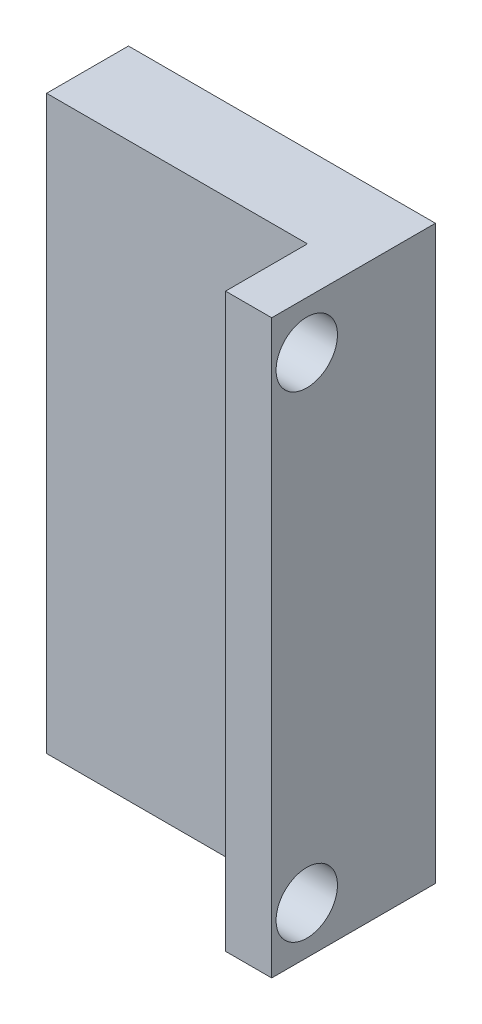
ISO-10303-21;
HEADER;
FILE_DESCRIPTION(('STEP AP214'),'2;1');
FILE_NAME('part.step','',(''),(''),'','','');
FILE_SCHEMA(('AUTOMOTIVE_DESIGN { 1 0 10303 214 1 1 1 1 }'));
ENDSEC;
DATA;
#1=APPLICATION_CONTEXT('core data for automotive mechanical design processes');
#2=APPLICATION_PROTOCOL_DEFINITION('international standard','automotive_design',2000,#1);
#3=PRODUCT_CONTEXT('',#1,'mechanical');
#4=PRODUCT('Part','Part','',(#3));
#5=PRODUCT_RELATED_PRODUCT_CATEGORY('part','',(#4));
#6=PRODUCT_DEFINITION_FORMATION('','',#4);
#7=PRODUCT_DEFINITION_CONTEXT('part definition',#1,'design');
#8=PRODUCT_DEFINITION('design','',#6,#7);
#9=PRODUCT_DEFINITION_SHAPE('','',#8);
#10=(LENGTH_UNIT() NAMED_UNIT(*) SI_UNIT(.MILLI.,.METRE.));
#11=(NAMED_UNIT(*) PLANE_ANGLE_UNIT() SI_UNIT($,.RADIAN.));
#12=(NAMED_UNIT(*) SI_UNIT($,.STERADIAN.) SOLID_ANGLE_UNIT());
#13=UNCERTAINTY_MEASURE_WITH_UNIT(LENGTH_MEASURE(1.E-05),#10,'distance_accuracy_value','');
#14=(GEOMETRIC_REPRESENTATION_CONTEXT(3) GLOBAL_UNCERTAINTY_ASSIGNED_CONTEXT((#13)) GLOBAL_UNIT_ASSIGNED_CONTEXT((#10,
#11,#12)) REPRESENTATION_CONTEXT('',''));
#15=CARTESIAN_POINT('',(0.,0.,0.));
#16=DIRECTION('',(0.,0.,1.));
#17=DIRECTION('',(1.,0.,0.));
#18=AXIS2_PLACEMENT_3D('',#15,#16,#17);
#19=CARTESIAN_POINT('',(0.,0.,5.));
#20=DIRECTION('',(1.,0.,0.));
#21=DIRECTION('',(0.,0.,-1.));
#22=AXIS2_PLACEMENT_3D('',#19,#20,#21);
#23=PLANE('',#22);
#24=DIRECTION('',(0.,-1.,0.));
#25=VECTOR('',#24,1.);
#26=CARTESIAN_POINT('',(0.,18.97,5.));
#27=LINE('',#26,#25);
#28=CARTESIAN_POINT('',(0.,18.97,5.));
#29=VERTEX_POINT('',#28);
#30=CARTESIAN_POINT('',(0.,-8.97,5.));
#31=VERTEX_POINT('',#30);
#32=EDGE_CURVE('E108',#29,#31,#27,.T.);
#33=ORIENTED_EDGE('',*,*,#32,.T.);
#34=DIRECTION('',(0.,0.,-1.));
#35=VECTOR('',#34,1.);
#36=CARTESIAN_POINT('',(0.,-8.97,9.));
#37=LINE('',#36,#35);
#38=CARTESIAN_POINT('',(0.,-8.97,9.));
#39=VERTEX_POINT('',#38);
#40=EDGE_CURVE('E48',#39,#31,#37,.T.);
#41=ORIENTED_EDGE('',*,*,#40,.F.);
#42=DIRECTION('',(0.,-1.,0.));
#43=VECTOR('',#42,1.);
#44=CARTESIAN_POINT('',(0.,18.97,9.));
#45=LINE('',#44,#43);
#46=CARTESIAN_POINT('',(0.,18.97,9.));
#47=VERTEX_POINT('',#46);
#48=EDGE_CURVE('E61',#47,#39,#45,.T.);
#49=ORIENTED_EDGE('',*,*,#48,.F.);
#50=DIRECTION('',(0.,0.,-1.));
#51=VECTOR('',#50,1.);
#52=CARTESIAN_POINT('',(0.,18.97,9.));
#53=LINE('',#52,#51);
#54=EDGE_CURVE('E11',#47,#29,#53,.T.);
#55=ORIENTED_EDGE('',*,*,#54,.T.);
#56=EDGE_LOOP('',(#33,#41,#49,#55));
#57=FACE_BOUND('',#56,.T.);
#58=ADVANCED_FACE('F41',(#57),#23,.F.);
#59=CARTESIAN_POINT('',(0.,0.,5.));
#60=DIRECTION('',(0.,0.,1.));
#61=DIRECTION('',(1.,0.,0.));
#62=AXIS2_PLACEMENT_3D('',#59,#60,#61);
#63=PLANE('',#62);
#64=DIRECTION('',(1.,0.,0.));
#65=VECTOR('',#64,1.);
#66=CARTESIAN_POINT('',(0.,-8.97,5.));
#67=LINE('',#66,#65);
#68=CARTESIAN_POINT('',(15.,-8.97,5.));
#69=VERTEX_POINT('',#68);
#70=EDGE_CURVE('E94',#31,#69,#67,.T.);
#71=ORIENTED_EDGE('',*,*,#70,.F.);
#72=ORIENTED_EDGE('',*,*,#32,.F.);
#73=DIRECTION('',(-1.,0.,0.));
#74=VECTOR('',#73,1.);
#75=CARTESIAN_POINT('',(15.,18.97,5.));
#76=LINE('',#75,#74);
#77=CARTESIAN_POINT('',(15.,18.97,5.));
#78=VERTEX_POINT('',#77);
#79=EDGE_CURVE('E100',#78,#29,#76,.T.);
#80=ORIENTED_EDGE('',*,*,#79,.F.);
#81=DIRECTION('',(0.,1.,0.));
#82=VECTOR('',#81,1.);
#83=CARTESIAN_POINT('',(15.,-8.97,5.));
#84=LINE('',#83,#82);
#85=EDGE_CURVE('E81',#69,#78,#84,.T.);
#86=ORIENTED_EDGE('',*,*,#85,.F.);
#87=EDGE_LOOP('',(#71,#72,#80,#86));
#88=FACE_BOUND('',#87,.T.);
#89=ADVANCED_FACE('F107',(#88),#63,.F.);
#90=CARTESIAN_POINT('',(15.,18.97,9.));
#91=DIRECTION('',(0.,-1.,0.));
#92=DIRECTION('',(0.,0.,-1.));
#93=AXIS2_PLACEMENT_3D('',#90,#91,#92);
#94=PLANE('',#93);
#95=ORIENTED_EDGE('',*,*,#79,.T.);
#96=ORIENTED_EDGE('',*,*,#54,.F.);
#97=DIRECTION('',(-1.,0.,0.));
#98=VECTOR('',#97,1.);
#99=CARTESIAN_POINT('',(15.,18.97,9.));
#100=LINE('',#99,#98);
#101=CARTESIAN_POINT('',(12.7455153503555,18.97,9.));
#102=VERTEX_POINT('',#101);
#103=EDGE_CURVE('E93',#102,#47,#100,.T.);
#104=ORIENTED_EDGE('',*,*,#103,.F.);
#105=DIRECTION('',(0.,0.,-1.));
#106=VECTOR('',#105,1.);
#107=CARTESIAN_POINT('',(12.7455153503555,18.97,13.));
#108=LINE('',#107,#106);
#109=CARTESIAN_POINT('',(12.7455153503555,18.97,13.));
#110=VERTEX_POINT('',#109);
#111=EDGE_CURVE('E109',#110,#102,#108,.T.);
#112=ORIENTED_EDGE('',*,*,#111,.F.);
#113=DIRECTION('',(-1.,0.,0.));
#114=VECTOR('',#113,1.);
#115=CARTESIAN_POINT('',(15.,18.97,13.));
#116=LINE('',#115,#114);
#117=CARTESIAN_POINT('',(15.,18.97,13.));
#118=VERTEX_POINT('',#117);
#119=EDGE_CURVE('E103',#118,#110,#116,.T.);
#120=ORIENTED_EDGE('',*,*,#119,.F.);
#121=DIRECTION('',(0.,0.,-1.));
#122=VECTOR('',#121,1.);
#123=CARTESIAN_POINT('',(15.,18.97,9.));
#124=LINE('',#123,#122);
#125=EDGE_CURVE('E86',#118,#78,#124,.T.);
#126=ORIENTED_EDGE('',*,*,#125,.T.);
#127=EDGE_LOOP('',(#95,#96,#104,#112,#120,#126));
#128=FACE_BOUND('',#127,.T.);
#129=ADVANCED_FACE('F98',(#128),#94,.F.);
#130=CARTESIAN_POINT('',(0.,-8.97,9.));
#131=DIRECTION('',(0.,1.,0.));
#132=DIRECTION('',(0.,0.,1.));
#133=AXIS2_PLACEMENT_3D('',#130,#131,#132);
#134=PLANE('',#133);
#135=ORIENTED_EDGE('',*,*,#70,.T.);
#136=DIRECTION('',(0.,0.,-1.));
#137=VECTOR('',#136,1.);
#138=CARTESIAN_POINT('',(15.,-8.97,9.));
#139=LINE('',#138,#137);
#140=CARTESIAN_POINT('',(15.,-8.97,13.));
#141=VERTEX_POINT('',#140);
#142=EDGE_CURVE('E89',#141,#69,#139,.T.);
#143=ORIENTED_EDGE('',*,*,#142,.F.);
#144=DIRECTION('',(1.,0.,0.));
#145=VECTOR('',#144,1.);
#146=CARTESIAN_POINT('',(15.,-8.97,13.));
#147=LINE('',#146,#145);
#148=CARTESIAN_POINT('',(12.7455153503555,-8.97,13.));
#149=VERTEX_POINT('',#148);
#150=EDGE_CURVE('E139',#149,#141,#147,.T.);
#151=ORIENTED_EDGE('',*,*,#150,.F.);
#152=DIRECTION('',(0.,0.,-1.));
#153=VECTOR('',#152,1.);
#154=CARTESIAN_POINT('',(12.7455153503555,-8.97,13.));
#155=LINE('',#154,#153);
#156=CARTESIAN_POINT('',(12.7455153503555,-8.97,9.));
#157=VERTEX_POINT('',#156);
#158=EDGE_CURVE('E113',#149,#157,#155,.T.);
#159=ORIENTED_EDGE('',*,*,#158,.T.);
#160=DIRECTION('',(1.,0.,0.));
#161=VECTOR('',#160,1.);
#162=CARTESIAN_POINT('',(0.,-8.97,9.));
#163=LINE('',#162,#161);
#164=EDGE_CURVE('E105',#39,#157,#163,.T.);
#165=ORIENTED_EDGE('',*,*,#164,.F.);
#166=ORIENTED_EDGE('',*,*,#40,.T.);
#167=EDGE_LOOP('',(#135,#143,#151,#159,#165,#166));
#168=FACE_BOUND('',#167,.T.);
#169=ADVANCED_FACE('F122',(#168),#134,.F.);
#170=CARTESIAN_POINT('',(15.,-8.97,9.));
#171=DIRECTION('',(-1.,0.,0.));
#172=DIRECTION('',(0.,0.,1.));
#173=AXIS2_PLACEMENT_3D('',#170,#171,#172);
#174=PLANE('',#173);
#175=CARTESIAN_POINT('',(15.,16.64426,11.286));
#176=DIRECTION('',(-1.,0.,0.));
#177=DIRECTION('',(0.,0.,1.));
#178=AXIS2_PLACEMENT_3D('',#175,#176,#177);
#179=CIRCLE('',#178,1.5);
#180=CARTESIAN_POINT('',(15.,16.64426,12.786));
#181=VERTEX_POINT('',#180);
#182=EDGE_CURVE('E147',#181,#181,#179,.T.);
#183=ORIENTED_EDGE('',*,*,#182,.T.);
#184=EDGE_LOOP('',(#183));
#185=FACE_BOUND('',#184,.T.);
#186=CARTESIAN_POINT('',(15.,-6.645,11.286));
#187=DIRECTION('',(-1.,0.,0.));
#188=DIRECTION('',(0.,0.,1.));
#189=AXIS2_PLACEMENT_3D('',#186,#187,#188);
#190=CIRCLE('',#189,1.5);
#191=CARTESIAN_POINT('',(15.,-6.645,12.786));
#192=VERTEX_POINT('',#191);
#193=EDGE_CURVE('E156',#192,#192,#190,.T.);
#194=ORIENTED_EDGE('',*,*,#193,.T.);
#195=EDGE_LOOP('',(#194));
#196=FACE_BOUND('',#195,.T.);
#197=ORIENTED_EDGE('',*,*,#85,.T.);
#198=ORIENTED_EDGE('',*,*,#125,.F.);
#199=DIRECTION('',(0.,1.,0.));
#200=VECTOR('',#199,1.);
#201=CARTESIAN_POINT('',(15.,18.97,13.));
#202=LINE('',#201,#200);
#203=EDGE_CURVE('E142',#141,#118,#202,.T.);
#204=ORIENTED_EDGE('',*,*,#203,.F.);
#205=ORIENTED_EDGE('',*,*,#142,.T.);
#206=EDGE_LOOP('',(#197,#198,#204,#205));
#207=FACE_BOUND('',#206,.T.);
#208=ADVANCED_FACE('F83',(#185,#196,#207),#174,.F.);
#209=CARTESIAN_POINT('',(0.,0.,9.));
#210=DIRECTION('',(0.,0.,1.));
#211=DIRECTION('',(1.,0.,0.));
#212=AXIS2_PLACEMENT_3D('',#209,#210,#211);
#213=PLANE('',#212);
#214=DIRECTION('',(0.,-1.,0.));
#215=VECTOR('',#214,1.);
#216=CARTESIAN_POINT('',(12.7455153503555,18.97,9.));
#217=LINE('',#216,#215);
#218=EDGE_CURVE('E55',#102,#157,#217,.T.);
#219=ORIENTED_EDGE('',*,*,#218,.F.);
#220=ORIENTED_EDGE('',*,*,#103,.T.);
#221=ORIENTED_EDGE('',*,*,#48,.T.);
#222=ORIENTED_EDGE('',*,*,#164,.T.);
#223=EDGE_LOOP('',(#219,#220,#221,#222));
#224=FACE_BOUND('',#223,.T.);
#225=ADVANCED_FACE('F148',(#224),#213,.T.);
#226=CARTESIAN_POINT('',(12.7455153503555,18.97,13.));
#227=DIRECTION('',(1.,0.,0.));
#228=DIRECTION('',(0.,0.,-1.));
#229=AXIS2_PLACEMENT_3D('',#226,#227,#228);
#230=PLANE('',#229);
#231=CARTESIAN_POINT('',(12.7455153503555,16.64426,11.286));
#232=DIRECTION('',(-1.,0.,0.));
#233=DIRECTION('',(0.,0.,1.));
#234=AXIS2_PLACEMENT_3D('',#231,#232,#233);
#235=CIRCLE('',#234,1.5);
#236=CARTESIAN_POINT('',(12.7455153503555,16.64426,12.786));
#237=VERTEX_POINT('',#236);
#238=EDGE_CURVE('E159',#237,#237,#235,.T.);
#239=ORIENTED_EDGE('',*,*,#238,.F.);
#240=EDGE_LOOP('',(#239));
#241=FACE_BOUND('',#240,.T.);
#242=CARTESIAN_POINT('',(12.7455153503555,-6.645,11.286));
#243=DIRECTION('',(-1.,0.,0.));
#244=DIRECTION('',(0.,0.,1.));
#245=AXIS2_PLACEMENT_3D('',#242,#243,#244);
#246=CIRCLE('',#245,1.5);
#247=CARTESIAN_POINT('',(12.7455153503555,-6.645,12.786));
#248=VERTEX_POINT('',#247);
#249=EDGE_CURVE('E160',#248,#248,#246,.T.);
#250=ORIENTED_EDGE('',*,*,#249,.F.);
#251=EDGE_LOOP('',(#250));
#252=FACE_BOUND('',#251,.T.);
#253=ORIENTED_EDGE('',*,*,#218,.T.);
#254=ORIENTED_EDGE('',*,*,#158,.F.);
#255=DIRECTION('',(0.,-1.,0.));
#256=VECTOR('',#255,1.);
#257=CARTESIAN_POINT('',(12.7455153503555,18.97,13.));
#258=LINE('',#257,#256);
#259=EDGE_CURVE('E133',#110,#149,#258,.T.);
#260=ORIENTED_EDGE('',*,*,#259,.F.);
#261=ORIENTED_EDGE('',*,*,#111,.T.);
#262=EDGE_LOOP('',(#253,#254,#260,#261));
#263=FACE_BOUND('',#262,.T.);
#264=ADVANCED_FACE('F129',(#241,#252,#263),#230,.F.);
#265=CARTESIAN_POINT('',(0.,0.,13.));
#266=DIRECTION('',(0.,0.,-1.));
#267=DIRECTION('',(-1.,0.,0.));
#268=AXIS2_PLACEMENT_3D('',#265,#266,#267);
#269=PLANE('',#268);
#270=ORIENTED_EDGE('',*,*,#203,.T.);
#271=ORIENTED_EDGE('',*,*,#119,.T.);
#272=ORIENTED_EDGE('',*,*,#259,.T.);
#273=ORIENTED_EDGE('',*,*,#150,.T.);
#274=EDGE_LOOP('',(#270,#271,#272,#273));
#275=FACE_BOUND('',#274,.T.);
#276=ADVANCED_FACE('F152',(#275),#269,.F.);
#277=CARTESIAN_POINT('',(52.7455153503555,-6.645,11.286));
#278=DIRECTION('',(-1.,0.,0.));
#279=DIRECTION('',(0.,0.,1.));
#280=AXIS2_PLACEMENT_3D('',#277,#278,#279);
#281=CYLINDRICAL_SURFACE('',#280,1.5);
#282=ORIENTED_EDGE('',*,*,#249,.T.);
#283=EDGE_LOOP('',(#282));
#284=FACE_BOUND('',#283,.T.);
#285=ORIENTED_EDGE('',*,*,#193,.F.);
#286=EDGE_LOOP('',(#285));
#287=FACE_BOUND('',#286,.T.);
#288=ADVANCED_FACE('F174',(#284,#287),#281,.F.);
#289=CARTESIAN_POINT('',(52.7455153503555,16.64426,11.286));
#290=DIRECTION('',(-1.,0.,0.));
#291=DIRECTION('',(0.,0.,1.));
#292=AXIS2_PLACEMENT_3D('',#289,#290,#291);
#293=CYLINDRICAL_SURFACE('',#292,1.5);
#294=ORIENTED_EDGE('',*,*,#238,.T.);
#295=EDGE_LOOP('',(#294));
#296=FACE_BOUND('',#295,.T.);
#297=ORIENTED_EDGE('',*,*,#182,.F.);
#298=EDGE_LOOP('',(#297));
#299=FACE_BOUND('',#298,.T.);
#300=ADVANCED_FACE('F166',(#296,#299),#293,.F.);
#301=CLOSED_SHELL('',(#58,#89,#129,#169,#208,#225,#264,#276,#288,#300));
#302=MANIFOLD_SOLID_BREP('B2',#301);
#303=ADVANCED_BREP_SHAPE_REPRESENTATION('',(#18,#302),#14);
#304=SHAPE_DEFINITION_REPRESENTATION(#9,#303);
ENDSEC;
END-ISO-10303-21;
